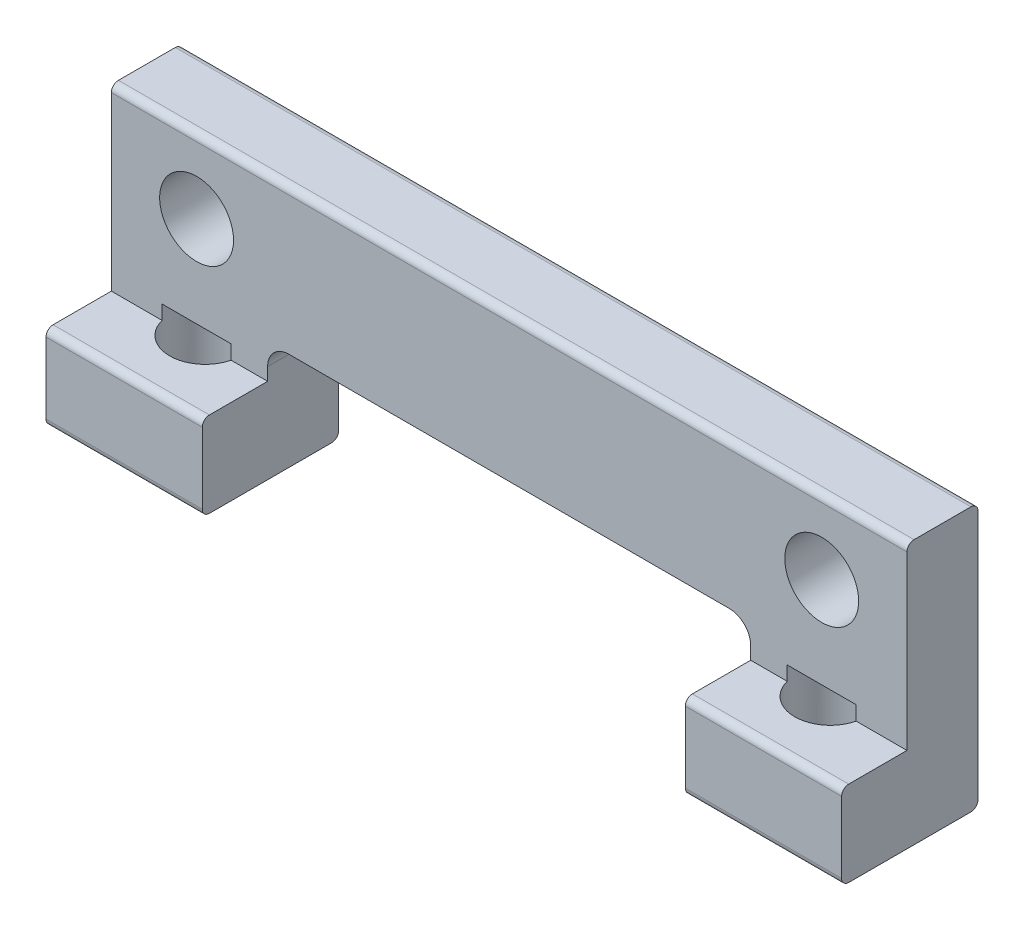
ISO-10303-21;
HEADER;
FILE_DESCRIPTION(('STEP AP214'),'2;1');
FILE_NAME('part.step','',(''),(''),'','','');
FILE_SCHEMA(('AUTOMOTIVE_DESIGN { 1 0 10303 214 1 1 1 1 }'));
ENDSEC;
DATA;
#1=APPLICATION_CONTEXT('core data for automotive mechanical design processes');
#2=APPLICATION_PROTOCOL_DEFINITION('international standard','automotive_design',2000,#1);
#3=PRODUCT_CONTEXT('',#1,'mechanical');
#4=PRODUCT('Part','Part','',(#3));
#5=PRODUCT_RELATED_PRODUCT_CATEGORY('part','',(#4));
#6=PRODUCT_DEFINITION_FORMATION('','',#4);
#7=PRODUCT_DEFINITION_CONTEXT('part definition',#1,'design');
#8=PRODUCT_DEFINITION('design','',#6,#7);
#9=PRODUCT_DEFINITION_SHAPE('','',#8);
#10=(LENGTH_UNIT() NAMED_UNIT(*) SI_UNIT(.MILLI.,.METRE.));
#11=(NAMED_UNIT(*) PLANE_ANGLE_UNIT() SI_UNIT($,.RADIAN.));
#12=(NAMED_UNIT(*) SI_UNIT($,.STERADIAN.) SOLID_ANGLE_UNIT());
#13=UNCERTAINTY_MEASURE_WITH_UNIT(LENGTH_MEASURE(1.E-05),#10,'distance_accuracy_value','');
#14=(GEOMETRIC_REPRESENTATION_CONTEXT(3) GLOBAL_UNCERTAINTY_ASSIGNED_CONTEXT((#13)) GLOBAL_UNIT_ASSIGNED_CONTEXT((#10,
#11,#12)) REPRESENTATION_CONTEXT('',''));
#15=CARTESIAN_POINT('',(0.,0.,0.));
#16=DIRECTION('',(0.,0.,1.));
#17=DIRECTION('',(1.,0.,0.));
#18=AXIS2_PLACEMENT_3D('',#15,#16,#17);
#19=CARTESIAN_POINT('',(0.,0.,4.8));
#20=DIRECTION('',(0.,1.,0.));
#21=DIRECTION('',(0.,0.,1.));
#22=AXIS2_PLACEMENT_3D('',#19,#20,#21);
#23=PLANE('',#22);
#24=CARTESIAN_POINT('',(3.,0.,2.2));
#25=DIRECTION('',(0.,-1.,0.));
#26=DIRECTION('',(0.,0.,-1.));
#27=AXIS2_PLACEMENT_3D('',#24,#25,#26);
#28=CIRCLE('',#27,1.25);
#29=CARTESIAN_POINT('',(3.,0.,0.95));
#30=VERTEX_POINT('',#29);
#31=EDGE_CURVE('E222',#30,#30,#28,.T.);
#32=ORIENTED_EDGE('',*,*,#31,.F.);
#33=EDGE_LOOP('',(#32));
#34=FACE_BOUND('',#33,.T.);
#35=DIRECTION('',(0.,0.,-1.));
#36=VECTOR('',#35,1.);
#37=CARTESIAN_POINT('',(0.,0.,4.8));
#38=LINE('',#37,#36);
#39=CARTESIAN_POINT('',(0.,0.,4.55));
#40=VERTEX_POINT('',#39);
#41=CARTESIAN_POINT('',(0.,0.,0.25));
#42=VERTEX_POINT('',#41);
#43=EDGE_CURVE('E310',#40,#42,#38,.T.);
#44=ORIENTED_EDGE('',*,*,#43,.T.);
#45=DIRECTION('',(1.,0.,0.));
#46=VECTOR('',#45,1.);
#47=CARTESIAN_POINT('',(5.5,0.,0.25));
#48=LINE('',#47,#46);
#49=CARTESIAN_POINT('',(5.5,0.,0.25));
#50=VERTEX_POINT('',#49);
#51=EDGE_CURVE('E11',#42,#50,#48,.T.);
#52=ORIENTED_EDGE('',*,*,#51,.T.);
#53=DIRECTION('',(0.,0.,1.));
#54=VECTOR('',#53,1.);
#55=CARTESIAN_POINT('',(5.5,0.,0.));
#56=LINE('',#55,#54);
#57=CARTESIAN_POINT('',(5.5,0.,4.55));
#58=VERTEX_POINT('',#57);
#59=EDGE_CURVE('E311',#50,#58,#56,.T.);
#60=ORIENTED_EDGE('',*,*,#59,.T.);
#61=DIRECTION('',(1.,0.,0.));
#62=VECTOR('',#61,1.);
#63=CARTESIAN_POINT('',(0.,0.,4.55));
#64=LINE('',#63,#62);
#65=EDGE_CURVE('E42',#58,#40,#64,.F.);
#66=ORIENTED_EDGE('',*,*,#65,.T.);
#67=EDGE_LOOP('',(#44,#52,#60,#66));
#68=FACE_BOUND('',#67,.T.);
#69=ADVANCED_FACE('F34',(#34,#68),#23,.F.);
#70=CARTESIAN_POINT('',(0.,0.,4.8));
#71=DIRECTION('',(0.,0.,-1.));
#72=DIRECTION('',(-1.,0.,0.));
#73=AXIS2_PLACEMENT_3D('',#70,#71,#72);
#74=PLANE('',#73);
#75=DIRECTION('',(0.,1.,0.));
#76=VECTOR('',#75,1.);
#77=CARTESIAN_POINT('',(5.5,0.,4.8));
#78=LINE('',#77,#76);
#79=CARTESIAN_POINT('',(5.5,0.25,4.8));
#80=VERTEX_POINT('',#79);
#81=CARTESIAN_POINT('',(5.5,2.75,4.8));
#82=VERTEX_POINT('',#81);
#83=EDGE_CURVE('E328',#80,#82,#78,.T.);
#84=ORIENTED_EDGE('',*,*,#83,.T.);
#85=DIRECTION('',(1.,0.,0.));
#86=VECTOR('',#85,1.);
#87=CARTESIAN_POINT('',(0.,2.75,4.8));
#88=LINE('',#87,#86);
#89=CARTESIAN_POINT('',(0.,2.75,4.8));
#90=VERTEX_POINT('',#89);
#91=EDGE_CURVE('E300',#82,#90,#88,.F.);
#92=ORIENTED_EDGE('',*,*,#91,.T.);
#93=DIRECTION('',(0.,-1.,0.));
#94=VECTOR('',#93,1.);
#95=CARTESIAN_POINT('',(0.,0.,4.8));
#96=LINE('',#95,#94);
#97=CARTESIAN_POINT('',(0.,0.25,4.8));
#98=VERTEX_POINT('',#97);
#99=EDGE_CURVE('E330',#90,#98,#96,.T.);
#100=ORIENTED_EDGE('',*,*,#99,.T.);
#101=DIRECTION('',(1.,0.,0.));
#102=VECTOR('',#101,1.);
#103=CARTESIAN_POINT('',(0.,0.25,4.8));
#104=LINE('',#103,#102);
#105=EDGE_CURVE('E297',#98,#80,#104,.T.);
#106=ORIENTED_EDGE('',*,*,#105,.T.);
#107=EDGE_LOOP('',(#84,#92,#100,#106));
#108=FACE_BOUND('',#107,.T.);
#109=ADVANCED_FACE('F327',(#108),#74,.F.);
#110=CARTESIAN_POINT('',(0.,3.,2.5));
#111=DIRECTION('',(0.,-1.,0.));
#112=DIRECTION('',(0.,0.,-1.));
#113=AXIS2_PLACEMENT_3D('',#110,#111,#112);
#114=PLANE('',#113);
#115=DIRECTION('',(0.,0.,1.));
#116=VECTOR('',#115,1.);
#117=CARTESIAN_POINT('',(0.,3.,2.5));
#118=LINE('',#117,#116);
#119=CARTESIAN_POINT('',(0.,3.,2.5));
#120=VERTEX_POINT('',#119);
#121=CARTESIAN_POINT('',(0.,3.,4.55));
#122=VERTEX_POINT('',#121);
#123=EDGE_CURVE('E348',#120,#122,#118,.T.);
#124=ORIENTED_EDGE('',*,*,#123,.T.);
#125=DIRECTION('',(1.,0.,0.));
#126=VECTOR('',#125,1.);
#127=CARTESIAN_POINT('',(0.,3.,4.55));
#128=LINE('',#127,#126);
#129=CARTESIAN_POINT('',(5.5,3.,4.55));
#130=VERTEX_POINT('',#129);
#131=EDGE_CURVE('E290',#122,#130,#128,.T.);
#132=ORIENTED_EDGE('',*,*,#131,.T.);
#133=DIRECTION('',(0.,0.,-1.));
#134=VECTOR('',#133,1.);
#135=CARTESIAN_POINT('',(5.5,3.,2.5));
#136=LINE('',#135,#134);
#137=CARTESIAN_POINT('',(5.5,3.,2.5));
#138=VERTEX_POINT('',#137);
#139=EDGE_CURVE('E334',#130,#138,#136,.T.);
#140=ORIENTED_EDGE('',*,*,#139,.T.);
#141=DIRECTION('',(1.,0.,0.));
#142=VECTOR('',#141,1.);
#143=CARTESIAN_POINT('',(0.,3.,2.5));
#144=LINE('',#143,#142);
#145=CARTESIAN_POINT('',(4.21346610995116,3.,2.5));
#146=VERTEX_POINT('',#145);
#147=EDGE_CURVE('E346',#146,#138,#144,.T.);
#148=ORIENTED_EDGE('',*,*,#147,.F.);
#149=CARTESIAN_POINT('',(3.,3.,2.2));
#150=DIRECTION('',(0.,-1.,0.));
#151=DIRECTION('',(0.,0.,-1.));
#152=AXIS2_PLACEMENT_3D('',#149,#150,#151);
#153=CIRCLE('',#152,1.25);
#154=CARTESIAN_POINT('',(1.78653389004884,3.,2.5));
#155=VERTEX_POINT('',#154);
#156=EDGE_CURVE('E750',#146,#155,#153,.T.);
#157=ORIENTED_EDGE('',*,*,#156,.T.);
#158=EDGE_CURVE('E342',#120,#155,#144,.T.);
#159=ORIENTED_EDGE('',*,*,#158,.F.);
#160=EDGE_LOOP('',(#124,#132,#140,#148,#157,#159));
#161=FACE_BOUND('',#160,.T.);
#162=ADVANCED_FACE('F453',(#161),#114,.F.);
#163=CARTESIAN_POINT('',(0.,0.,4.8));
#164=DIRECTION('',(1.,0.,0.));
#165=DIRECTION('',(0.,0.,-1.));
#166=AXIS2_PLACEMENT_3D('',#163,#164,#165);
#167=PLANE('',#166);
#168=DIRECTION('',(0.,0.,-1.));
#169=VECTOR('',#168,1.);
#170=CARTESIAN_POINT('',(0.,9.3,4.8));
#171=LINE('',#170,#169);
#172=CARTESIAN_POINT('',(0.,9.3,2.25));
#173=VERTEX_POINT('',#172);
#174=CARTESIAN_POINT('',(0.,9.3,0.25));
#175=VERTEX_POINT('',#174);
#176=EDGE_CURVE('E360',#173,#175,#171,.T.);
#177=ORIENTED_EDGE('',*,*,#176,.T.);
#178=CARTESIAN_POINT('',(0.,9.05,0.25));
#179=DIRECTION('',(1.,0.,0.));
#180=DIRECTION('',(0.,0.,-1.));
#181=AXIS2_PLACEMENT_3D('',#178,#179,#180);
#182=CIRCLE('',#181,0.25);
#183=CARTESIAN_POINT('',(0.,9.05,0.));
#184=VERTEX_POINT('',#183);
#185=EDGE_CURVE('E255',#175,#184,#182,.F.);
#186=ORIENTED_EDGE('',*,*,#185,.T.);
#187=DIRECTION('',(0.,-1.,0.));
#188=VECTOR('',#187,1.);
#189=CARTESIAN_POINT('',(0.,0.,0.));
#190=LINE('',#189,#188);
#191=CARTESIAN_POINT('',(0.,0.25,0.));
#192=VERTEX_POINT('',#191);
#193=EDGE_CURVE('E352',#184,#192,#190,.T.);
#194=ORIENTED_EDGE('',*,*,#193,.T.);
#195=CARTESIAN_POINT('',(0.,0.25,0.25));
#196=DIRECTION('',(1.,0.,0.));
#197=DIRECTION('',(0.,0.,-1.));
#198=AXIS2_PLACEMENT_3D('',#195,#196,#197);
#199=CIRCLE('',#198,0.25);
#200=EDGE_CURVE('E249',#192,#42,#199,.F.);
#201=ORIENTED_EDGE('',*,*,#200,.T.);
#202=ORIENTED_EDGE('',*,*,#43,.F.);
#203=CARTESIAN_POINT('',(0.,0.25,4.55));
#204=DIRECTION('',(1.,0.,0.));
#205=DIRECTION('',(0.,0.,-1.));
#206=AXIS2_PLACEMENT_3D('',#203,#204,#205);
#207=CIRCLE('',#206,0.25);
#208=EDGE_CURVE('E247',#40,#98,#207,.F.);
#209=ORIENTED_EDGE('',*,*,#208,.T.);
#210=ORIENTED_EDGE('',*,*,#99,.F.);
#211=CARTESIAN_POINT('',(0.,2.75,4.55));
#212=DIRECTION('',(1.,0.,0.));
#213=DIRECTION('',(0.,0.,-1.));
#214=AXIS2_PLACEMENT_3D('',#211,#212,#213);
#215=CIRCLE('',#214,0.25);
#216=EDGE_CURVE('E251',#90,#122,#215,.F.);
#217=ORIENTED_EDGE('',*,*,#216,.T.);
#218=ORIENTED_EDGE('',*,*,#123,.F.);
#219=DIRECTION('',(0.,-1.,0.));
#220=VECTOR('',#219,1.);
#221=CARTESIAN_POINT('',(0.,3.,2.5));
#222=LINE('',#221,#220);
#223=CARTESIAN_POINT('',(0.,9.05,2.5));
#224=VERTEX_POINT('',#223);
#225=EDGE_CURVE('E333',#224,#120,#222,.T.);
#226=ORIENTED_EDGE('',*,*,#225,.F.);
#227=CARTESIAN_POINT('',(0.,9.05,2.25));
#228=DIRECTION('',(1.,0.,0.));
#229=DIRECTION('',(0.,0.,-1.));
#230=AXIS2_PLACEMENT_3D('',#227,#228,#229);
#231=CIRCLE('',#230,0.25);
#232=EDGE_CURVE('E253',#224,#173,#231,.F.);
#233=ORIENTED_EDGE('',*,*,#232,.T.);
#234=EDGE_LOOP('',(#177,#186,#194,#201,#202,#209,#210,#217,#218,#226,#233));
#235=FACE_BOUND('',#234,.T.);
#236=ADVANCED_FACE('F316',(#235),#167,.F.);
#237=CARTESIAN_POINT('',(25.,0.,2.2));
#238=DIRECTION('',(0.,-1.,0.));
#239=DIRECTION('',(0.,0.,1.));
#240=AXIS2_PLACEMENT_3D('',#237,#238,#239);
#241=CIRCLE('',#240,1.25);
#242=CARTESIAN_POINT('',(25.,0.,3.45));
#243=VERTEX_POINT('',#242);
#244=EDGE_CURVE('E223',#243,#243,#241,.T.);
#245=ORIENTED_EDGE('',*,*,#244,.F.);
#246=EDGE_LOOP('',(#245));
#247=FACE_BOUND('',#246,.T.);
#248=DIRECTION('',(0.,0.,1.));
#249=VECTOR('',#248,1.);
#250=CARTESIAN_POINT('',(22.5,0.,0.));
#251=LINE('',#250,#249);
#252=CARTESIAN_POINT('',(22.5,0.,0.25));
#253=VERTEX_POINT('',#252);
#254=CARTESIAN_POINT('',(22.5,0.,4.55));
#255=VERTEX_POINT('',#254);
#256=EDGE_CURVE('E431',#253,#255,#251,.T.);
#257=ORIENTED_EDGE('',*,*,#256,.F.);
#258=DIRECTION('',(1.,0.,0.));
#259=VECTOR('',#258,1.);
#260=CARTESIAN_POINT('',(28.,0.,0.25));
#261=LINE('',#260,#259);
#262=CARTESIAN_POINT('',(28.,0.,0.25));
#263=VERTEX_POINT('',#262);
#264=EDGE_CURVE('E304',#253,#263,#261,.T.);
#265=ORIENTED_EDGE('',*,*,#264,.T.);
#266=DIRECTION('',(0.,0.,-1.));
#267=VECTOR('',#266,1.);
#268=CARTESIAN_POINT('',(28.,0.,4.8));
#269=LINE('',#268,#267);
#270=CARTESIAN_POINT('',(28.,0.,4.55));
#271=VERTEX_POINT('',#270);
#272=EDGE_CURVE('E322',#271,#263,#269,.T.);
#273=ORIENTED_EDGE('',*,*,#272,.F.);
#274=DIRECTION('',(1.,0.,0.));
#275=VECTOR('',#274,1.);
#276=CARTESIAN_POINT('',(0.,0.,4.55));
#277=LINE('',#276,#275);
#278=EDGE_CURVE('E302',#271,#255,#277,.F.);
#279=ORIENTED_EDGE('',*,*,#278,.T.);
#280=EDGE_LOOP('',(#257,#265,#273,#279));
#281=FACE_BOUND('',#280,.T.);
#282=ADVANCED_FACE('F473',(#247,#281),#23,.F.);
#283=CARTESIAN_POINT('',(28.,0.,4.8));
#284=DIRECTION('',(-1.,0.,0.));
#285=DIRECTION('',(0.,0.,1.));
#286=AXIS2_PLACEMENT_3D('',#283,#284,#285);
#287=PLANE('',#286);
#288=DIRECTION('',(0.,1.,0.));
#289=VECTOR('',#288,1.);
#290=CARTESIAN_POINT('',(28.,0.,0.));
#291=LINE('',#290,#289);
#292=CARTESIAN_POINT('',(28.,0.25,0.));
#293=VERTEX_POINT('',#292);
#294=CARTESIAN_POINT('',(28.,9.05,0.));
#295=VERTEX_POINT('',#294);
#296=EDGE_CURVE('E357',#293,#295,#291,.T.);
#297=ORIENTED_EDGE('',*,*,#296,.T.);
#298=CARTESIAN_POINT('',(28.,9.05,0.25));
#299=DIRECTION('',(-1.,0.,0.));
#300=DIRECTION('',(0.,0.,1.));
#301=AXIS2_PLACEMENT_3D('',#298,#299,#300);
#302=CIRCLE('',#301,0.25);
#303=CARTESIAN_POINT('',(28.,9.3,0.25));
#304=VERTEX_POINT('',#303);
#305=EDGE_CURVE('E271',#295,#304,#302,.F.);
#306=ORIENTED_EDGE('',*,*,#305,.T.);
#307=DIRECTION('',(0.,0.,-1.));
#308=VECTOR('',#307,1.);
#309=CARTESIAN_POINT('',(28.,9.3,4.8));
#310=LINE('',#309,#308);
#311=CARTESIAN_POINT('',(28.,9.3,2.25));
#312=VERTEX_POINT('',#311);
#313=EDGE_CURVE('E365',#312,#304,#310,.T.);
#314=ORIENTED_EDGE('',*,*,#313,.F.);
#315=CARTESIAN_POINT('',(28.,9.05,2.25));
#316=DIRECTION('',(-1.,0.,0.));
#317=DIRECTION('',(0.,0.,1.));
#318=AXIS2_PLACEMENT_3D('',#315,#316,#317);
#319=CIRCLE('',#318,0.25);
#320=CARTESIAN_POINT('',(28.,9.05,2.5));
#321=VERTEX_POINT('',#320);
#322=EDGE_CURVE('E269',#312,#321,#319,.F.);
#323=ORIENTED_EDGE('',*,*,#322,.T.);
#324=DIRECTION('',(0.,1.,0.));
#325=VECTOR('',#324,1.);
#326=CARTESIAN_POINT('',(28.,3.,2.5));
#327=LINE('',#326,#325);
#328=CARTESIAN_POINT('',(28.,3.,2.5));
#329=VERTEX_POINT('',#328);
#330=EDGE_CURVE('E345',#329,#321,#327,.T.);
#331=ORIENTED_EDGE('',*,*,#330,.F.);
#332=DIRECTION('',(0.,0.,1.));
#333=VECTOR('',#332,1.);
#334=CARTESIAN_POINT('',(28.,3.,2.5));
#335=LINE('',#334,#333);
#336=CARTESIAN_POINT('',(28.,3.,4.55));
#337=VERTEX_POINT('',#336);
#338=EDGE_CURVE('E349',#329,#337,#335,.T.);
#339=ORIENTED_EDGE('',*,*,#338,.T.);
#340=CARTESIAN_POINT('',(28.,2.75,4.55));
#341=DIRECTION('',(-1.,0.,0.));
#342=DIRECTION('',(0.,0.,1.));
#343=AXIS2_PLACEMENT_3D('',#340,#341,#342);
#344=CIRCLE('',#343,0.25);
#345=CARTESIAN_POINT('',(28.,2.75,4.8));
#346=VERTEX_POINT('',#345);
#347=EDGE_CURVE('E267',#337,#346,#344,.F.);
#348=ORIENTED_EDGE('',*,*,#347,.T.);
#349=DIRECTION('',(0.,1.,0.));
#350=VECTOR('',#349,1.);
#351=CARTESIAN_POINT('',(28.,0.,4.8));
#352=LINE('',#351,#350);
#353=CARTESIAN_POINT('',(28.,0.25,4.8));
#354=VERTEX_POINT('',#353);
#355=EDGE_CURVE('E356',#354,#346,#352,.T.);
#356=ORIENTED_EDGE('',*,*,#355,.F.);
#357=CARTESIAN_POINT('',(28.,0.25,4.55));
#358=DIRECTION('',(-1.,0.,0.));
#359=DIRECTION('',(0.,0.,1.));
#360=AXIS2_PLACEMENT_3D('',#357,#358,#359);
#361=CIRCLE('',#360,0.25);
#362=EDGE_CURVE('E263',#354,#271,#361,.F.);
#363=ORIENTED_EDGE('',*,*,#362,.T.);
#364=ORIENTED_EDGE('',*,*,#272,.T.);
#365=CARTESIAN_POINT('',(28.,0.25,0.25));
#366=DIRECTION('',(-1.,0.,0.));
#367=DIRECTION('',(0.,0.,1.));
#368=AXIS2_PLACEMENT_3D('',#365,#366,#367);
#369=CIRCLE('',#368,0.25);
#370=EDGE_CURVE('E265',#263,#293,#369,.F.);
#371=ORIENTED_EDGE('',*,*,#370,.T.);
#372=EDGE_LOOP('',(#297,#306,#314,#323,#331,#339,#348,#356,#363,#364,#371));
#373=FACE_BOUND('',#372,.T.);
#374=ADVANCED_FACE('F440',(#373),#287,.F.);
#375=CARTESIAN_POINT('',(0.,9.3,4.8));
#376=DIRECTION('',(0.,-1.,0.));
#377=DIRECTION('',(0.,0.,-1.));
#378=AXIS2_PLACEMENT_3D('',#375,#376,#377);
#379=PLANE('',#378);
#380=ORIENTED_EDGE('',*,*,#313,.T.);
#381=DIRECTION('',(-1.,0.,0.));
#382=VECTOR('',#381,1.);
#383=CARTESIAN_POINT('',(0.,9.3,0.25));
#384=LINE('',#383,#382);
#385=EDGE_CURVE('E244',#304,#175,#384,.T.);
#386=ORIENTED_EDGE('',*,*,#385,.T.);
#387=ORIENTED_EDGE('',*,*,#176,.F.);
#388=DIRECTION('',(-1.,0.,0.));
#389=VECTOR('',#388,1.);
#390=CARTESIAN_POINT('',(0.,9.3,2.25));
#391=LINE('',#390,#389);
#392=EDGE_CURVE('E242',#173,#312,#391,.F.);
#393=ORIENTED_EDGE('',*,*,#392,.T.);
#394=EDGE_LOOP('',(#380,#386,#387,#393));
#395=FACE_BOUND('',#394,.T.);
#396=ADVANCED_FACE('F488',(#395),#379,.F.);
#397=ORIENTED_EDGE('',*,*,#355,.T.);
#398=DIRECTION('',(1.,0.,0.));
#399=VECTOR('',#398,1.);
#400=CARTESIAN_POINT('',(0.,2.75,4.8));
#401=LINE('',#400,#399);
#402=CARTESIAN_POINT('',(22.5,2.75,4.8));
#403=VERTEX_POINT('',#402);
#404=EDGE_CURVE('E282',#346,#403,#401,.F.);
#405=ORIENTED_EDGE('',*,*,#404,.T.);
#406=DIRECTION('',(0.,-1.,0.));
#407=VECTOR('',#406,1.);
#408=CARTESIAN_POINT('',(22.5,0.,4.8));
#409=LINE('',#408,#407);
#410=CARTESIAN_POINT('',(22.5,0.25,4.8));
#411=VERTEX_POINT('',#410);
#412=EDGE_CURVE('E338',#403,#411,#409,.T.);
#413=ORIENTED_EDGE('',*,*,#412,.T.);
#414=DIRECTION('',(1.,0.,0.));
#415=VECTOR('',#414,1.);
#416=CARTESIAN_POINT('',(0.,0.25,4.8));
#417=LINE('',#416,#415);
#418=EDGE_CURVE('E279',#411,#354,#417,.T.);
#419=ORIENTED_EDGE('',*,*,#418,.T.);
#420=EDGE_LOOP('',(#397,#405,#413,#419));
#421=FACE_BOUND('',#420,.T.);
#422=ADVANCED_FACE('F478',(#421),#74,.F.);
#423=CARTESIAN_POINT('',(0.,0.,0.));
#424=DIRECTION('',(0.,0.,-1.));
#425=DIRECTION('',(-1.,0.,0.));
#426=AXIS2_PLACEMENT_3D('',#423,#424,#425);
#427=PLANE('',#426);
#428=CARTESIAN_POINT('',(3.,6.7,0.));
#429=DIRECTION('',(0.,0.,1.));
#430=DIRECTION('',(1.,0.,0.));
#431=AXIS2_PLACEMENT_3D('',#428,#429,#430);
#432=CIRCLE('',#431,1.3);
#433=CARTESIAN_POINT('',(4.3,6.7,0.));
#434=VERTEX_POINT('',#433);
#435=EDGE_CURVE('E408',#434,#434,#432,.T.);
#436=ORIENTED_EDGE('',*,*,#435,.T.);
#437=EDGE_LOOP('',(#436));
#438=FACE_BOUND('',#437,.T.);
#439=CARTESIAN_POINT('',(25.,6.7,0.));
#440=DIRECTION('',(0.,0.,1.));
#441=DIRECTION('',(-1.,0.,0.));
#442=AXIS2_PLACEMENT_3D('',#439,#440,#441);
#443=CIRCLE('',#442,1.3);
#444=CARTESIAN_POINT('',(23.7,6.7,0.));
#445=VERTEX_POINT('',#444);
#446=EDGE_CURVE('E745',#445,#445,#443,.T.);
#447=ORIENTED_EDGE('',*,*,#446,.T.);
#448=EDGE_LOOP('',(#447));
#449=FACE_BOUND('',#448,.T.);
#450=ORIENTED_EDGE('',*,*,#193,.F.);
#451=DIRECTION('',(-1.,0.,0.));
#452=VECTOR('',#451,1.);
#453=CARTESIAN_POINT('',(28.,9.05,0.));
#454=LINE('',#453,#452);
#455=EDGE_CURVE('E261',#184,#295,#454,.F.);
#456=ORIENTED_EDGE('',*,*,#455,.T.);
#457=ORIENTED_EDGE('',*,*,#296,.F.);
#458=DIRECTION('',(1.,0.,0.));
#459=VECTOR('',#458,1.);
#460=CARTESIAN_POINT('',(22.5,0.25,0.));
#461=LINE('',#460,#459);
#462=CARTESIAN_POINT('',(22.5,0.25,0.));
#463=VERTEX_POINT('',#462);
#464=EDGE_CURVE('E259',#293,#463,#461,.F.);
#465=ORIENTED_EDGE('',*,*,#464,.T.);
#466=DIRECTION('',(0.,1.,0.));
#467=VECTOR('',#466,1.);
#468=CARTESIAN_POINT('',(22.5,0.,0.));
#469=LINE('',#468,#467);
#470=CARTESIAN_POINT('',(22.5,3.45,0.));
#471=VERTEX_POINT('',#470);
#472=EDGE_CURVE('E407',#463,#471,#469,.T.);
#473=ORIENTED_EDGE('',*,*,#472,.T.);
#474=CARTESIAN_POINT('',(21.75,3.45,0.));
#475=DIRECTION('',(0.,0.,-1.));
#476=DIRECTION('',(-1.,0.,0.));
#477=AXIS2_PLACEMENT_3D('',#474,#475,#476);
#478=CIRCLE('',#477,0.75);
#479=CARTESIAN_POINT('',(21.75,4.2,0.));
#480=VERTEX_POINT('',#479);
#481=EDGE_CURVE('E390',#471,#480,#478,.F.);
#482=ORIENTED_EDGE('',*,*,#481,.T.);
#483=DIRECTION('',(-1.,0.,0.));
#484=VECTOR('',#483,1.);
#485=CARTESIAN_POINT('',(5.5,4.2,0.));
#486=LINE('',#485,#484);
#487=CARTESIAN_POINT('',(6.25,4.2,0.));
#488=VERTEX_POINT('',#487);
#489=EDGE_CURVE('E402',#480,#488,#486,.T.);
#490=ORIENTED_EDGE('',*,*,#489,.T.);
#491=CARTESIAN_POINT('',(6.25,3.45,0.));
#492=DIRECTION('',(0.,0.,-1.));
#493=DIRECTION('',(-1.,0.,0.));
#494=AXIS2_PLACEMENT_3D('',#491,#492,#493);
#495=CIRCLE('',#494,0.75);
#496=CARTESIAN_POINT('',(5.5,3.45,0.));
#497=VERTEX_POINT('',#496);
#498=EDGE_CURVE('E216',#488,#497,#495,.F.);
#499=ORIENTED_EDGE('',*,*,#498,.T.);
#500=DIRECTION('',(0.,-1.,0.));
#501=VECTOR('',#500,1.);
#502=CARTESIAN_POINT('',(5.5,0.,0.));
#503=LINE('',#502,#501);
#504=CARTESIAN_POINT('',(5.5,0.25,0.));
#505=VERTEX_POINT('',#504);
#506=EDGE_CURVE('E400',#497,#505,#503,.T.);
#507=ORIENTED_EDGE('',*,*,#506,.T.);
#508=DIRECTION('',(1.,0.,0.));
#509=VECTOR('',#508,1.);
#510=CARTESIAN_POINT('',(0.,0.25,0.));
#511=LINE('',#510,#509);
#512=EDGE_CURVE('E257',#505,#192,#511,.F.);
#513=ORIENTED_EDGE('',*,*,#512,.T.);
#514=EDGE_LOOP('',(#450,#456,#457,#465,#473,#482,#490,#499,#507,#513));
#515=FACE_BOUND('',#514,.T.);
#516=ADVANCED_FACE('F399',(#438,#449,#515),#427,.T.);
#517=DIRECTION('',(0.,0.,1.));
#518=VECTOR('',#517,1.);
#519=CARTESIAN_POINT('',(22.5,3.,2.5));
#520=LINE('',#519,#518);
#521=CARTESIAN_POINT('',(22.5,3.,2.5));
#522=VERTEX_POINT('',#521);
#523=CARTESIAN_POINT('',(22.5,3.,4.55));
#524=VERTEX_POINT('',#523);
#525=EDGE_CURVE('E427',#522,#524,#520,.T.);
#526=ORIENTED_EDGE('',*,*,#525,.T.);
#527=DIRECTION('',(1.,0.,0.));
#528=VECTOR('',#527,1.);
#529=CARTESIAN_POINT('',(0.,3.,4.55));
#530=LINE('',#529,#528);
#531=EDGE_CURVE('E276',#524,#337,#530,.T.);
#532=ORIENTED_EDGE('',*,*,#531,.T.);
#533=ORIENTED_EDGE('',*,*,#338,.F.);
#534=CARTESIAN_POINT('',(26.2134661099512,3.,2.5));
#535=VERTEX_POINT('',#534);
#536=EDGE_CURVE('E336',#535,#329,#144,.T.);
#537=ORIENTED_EDGE('',*,*,#536,.F.);
#538=CARTESIAN_POINT('',(25.,3.,2.2));
#539=DIRECTION('',(0.,-1.,0.));
#540=DIRECTION('',(0.,0.,-1.));
#541=AXIS2_PLACEMENT_3D('',#538,#539,#540);
#542=CIRCLE('',#541,1.25);
#543=CARTESIAN_POINT('',(23.7865338900488,3.,2.5));
#544=VERTEX_POINT('',#543);
#545=EDGE_CURVE('E435',#535,#544,#542,.T.);
#546=ORIENTED_EDGE('',*,*,#545,.T.);
#547=EDGE_CURVE('E229',#522,#544,#144,.T.);
#548=ORIENTED_EDGE('',*,*,#547,.F.);
#549=EDGE_LOOP('',(#526,#532,#533,#537,#546,#548));
#550=FACE_BOUND('',#549,.T.);
#551=ADVANCED_FACE('F433',(#550),#114,.F.);
#552=CARTESIAN_POINT('',(0.,0.,2.5));
#553=DIRECTION('',(0.,0.,-1.));
#554=DIRECTION('',(-1.,0.,0.));
#555=AXIS2_PLACEMENT_3D('',#552,#553,#554);
#556=PLANE('',#555);
#557=CARTESIAN_POINT('',(3.,6.7,2.5));
#558=DIRECTION('',(0.,0.,1.));
#559=DIRECTION('',(1.,0.,0.));
#560=AXIS2_PLACEMENT_3D('',#557,#558,#559);
#561=CIRCLE('',#560,1.3);
#562=CARTESIAN_POINT('',(4.3,6.7,2.5));
#563=VERTEX_POINT('',#562);
#564=EDGE_CURVE('E752',#563,#563,#561,.T.);
#565=ORIENTED_EDGE('',*,*,#564,.F.);
#566=EDGE_LOOP('',(#565));
#567=FACE_BOUND('',#566,.T.);
#568=CARTESIAN_POINT('',(25.,6.7,2.5));
#569=DIRECTION('',(0.,0.,1.));
#570=DIRECTION('',(-1.,0.,0.));
#571=AXIS2_PLACEMENT_3D('',#568,#569,#570);
#572=CIRCLE('',#571,1.3);
#573=CARTESIAN_POINT('',(23.7,6.7,2.5));
#574=VERTEX_POINT('',#573);
#575=EDGE_CURVE('E748',#574,#574,#572,.T.);
#576=ORIENTED_EDGE('',*,*,#575,.F.);
#577=EDGE_LOOP('',(#576));
#578=FACE_BOUND('',#577,.T.);
#579=ORIENTED_EDGE('',*,*,#330,.T.);
#580=DIRECTION('',(-1.,0.,0.));
#581=VECTOR('',#580,1.);
#582=CARTESIAN_POINT('',(0.,9.05,2.5));
#583=LINE('',#582,#581);
#584=EDGE_CURVE('E273',#321,#224,#583,.T.);
#585=ORIENTED_EDGE('',*,*,#584,.T.);
#586=ORIENTED_EDGE('',*,*,#225,.T.);
#587=ORIENTED_EDGE('',*,*,#158,.T.);
#588=DIRECTION('',(0.,-1.,0.));
#589=VECTOR('',#588,1.);
#590=CARTESIAN_POINT('',(1.78653389004884,3.5,2.5));
#591=LINE('',#590,#589);
#592=CARTESIAN_POINT('',(1.78653389004884,3.5,2.5));
#593=VERTEX_POINT('',#592);
#594=EDGE_CURVE('E236',#155,#593,#591,.F.);
#595=ORIENTED_EDGE('',*,*,#594,.T.);
#596=DIRECTION('',(-1.,0.,0.));
#597=VECTOR('',#596,1.);
#598=CARTESIAN_POINT('',(0.,3.5,2.5));
#599=LINE('',#598,#597);
#600=CARTESIAN_POINT('',(4.21346610995116,3.5,2.5));
#601=VERTEX_POINT('',#600);
#602=EDGE_CURVE('E231',#601,#593,#599,.T.);
#603=ORIENTED_EDGE('',*,*,#602,.F.);
#604=DIRECTION('',(0.,-1.,0.));
#605=VECTOR('',#604,1.);
#606=CARTESIAN_POINT('',(4.21346610995116,3.5,2.5));
#607=LINE('',#606,#605);
#608=EDGE_CURVE('E239',#601,#146,#607,.T.);
#609=ORIENTED_EDGE('',*,*,#608,.T.);
#610=ORIENTED_EDGE('',*,*,#147,.T.);
#611=DIRECTION('',(0.,1.,0.));
#612=VECTOR('',#611,1.);
#613=CARTESIAN_POINT('',(5.5,0.,2.5));
#614=LINE('',#613,#612);
#615=CARTESIAN_POINT('',(5.5,3.45,2.5));
#616=VERTEX_POINT('',#615);
#617=EDGE_CURVE('E374',#138,#616,#614,.T.);
#618=ORIENTED_EDGE('',*,*,#617,.T.);
#619=CARTESIAN_POINT('',(6.25,3.45,2.5));
#620=DIRECTION('',(0.,0.,-1.));
#621=DIRECTION('',(-1.,0.,0.));
#622=AXIS2_PLACEMENT_3D('',#619,#620,#621);
#623=CIRCLE('',#622,0.75);
#624=CARTESIAN_POINT('',(6.25,4.2,2.5));
#625=VERTEX_POINT('',#624);
#626=EDGE_CURVE('E392',#616,#625,#623,.T.);
#627=ORIENTED_EDGE('',*,*,#626,.T.);
#628=DIRECTION('',(1.,0.,0.));
#629=VECTOR('',#628,1.);
#630=CARTESIAN_POINT('',(0.,4.2,2.5));
#631=LINE('',#630,#629);
#632=CARTESIAN_POINT('',(21.75,4.2,2.5));
#633=VERTEX_POINT('',#632);
#634=EDGE_CURVE('E371',#625,#633,#631,.T.);
#635=ORIENTED_EDGE('',*,*,#634,.T.);
#636=CARTESIAN_POINT('',(21.75,3.45,2.5));
#637=DIRECTION('',(0.,0.,-1.));
#638=DIRECTION('',(-1.,0.,0.));
#639=AXIS2_PLACEMENT_3D('',#636,#637,#638);
#640=CIRCLE('',#639,0.75);
#641=CARTESIAN_POINT('',(22.5,3.45,2.5));
#642=VERTEX_POINT('',#641);
#643=EDGE_CURVE('E388',#633,#642,#640,.T.);
#644=ORIENTED_EDGE('',*,*,#643,.T.);
#645=DIRECTION('',(0.,-1.,0.));
#646=VECTOR('',#645,1.);
#647=CARTESIAN_POINT('',(22.5,0.,2.5));
#648=LINE('',#647,#646);
#649=EDGE_CURVE('E321',#642,#522,#648,.T.);
#650=ORIENTED_EDGE('',*,*,#649,.T.);
#651=ORIENTED_EDGE('',*,*,#547,.T.);
#652=DIRECTION('',(0.,-1.,0.));
#653=VECTOR('',#652,1.);
#654=CARTESIAN_POINT('',(23.7865338900488,3.5,2.5));
#655=LINE('',#654,#653);
#656=CARTESIAN_POINT('',(23.7865338900488,3.5,2.5));
#657=VERTEX_POINT('',#656);
#658=EDGE_CURVE('E215',#544,#657,#655,.F.);
#659=ORIENTED_EDGE('',*,*,#658,.T.);
#660=DIRECTION('',(1.,0.,0.));
#661=VECTOR('',#660,1.);
#662=CARTESIAN_POINT('',(0.,3.5,2.5));
#663=LINE('',#662,#661);
#664=CARTESIAN_POINT('',(26.2134661099512,3.5,2.5));
#665=VERTEX_POINT('',#664);
#666=EDGE_CURVE('E207',#657,#665,#663,.T.);
#667=ORIENTED_EDGE('',*,*,#666,.T.);
#668=DIRECTION('',(0.,-1.,0.));
#669=VECTOR('',#668,1.);
#670=CARTESIAN_POINT('',(26.2134661099512,3.5,2.5));
#671=LINE('',#670,#669);
#672=EDGE_CURVE('E221',#665,#535,#671,.T.);
#673=ORIENTED_EDGE('',*,*,#672,.T.);
#674=ORIENTED_EDGE('',*,*,#536,.T.);
#675=EDGE_LOOP('',(#579,#585,#586,#587,#595,#603,#609,#610,#618,#627,#635,#644,#650,#651,#659,
#667,#673,#674));
#676=FACE_BOUND('',#675,.T.);
#677=ADVANCED_FACE('F227',(#567,#578,#676),#556,.F.);
#678=CARTESIAN_POINT('',(5.5,0.,0.));
#679=DIRECTION('',(-1.,0.,0.));
#680=DIRECTION('',(0.,0.,1.));
#681=AXIS2_PLACEMENT_3D('',#678,#679,#680);
#682=PLANE('',#681);
#683=ORIENTED_EDGE('',*,*,#139,.F.);
#684=CARTESIAN_POINT('',(5.5,2.75,4.55));
#685=DIRECTION('',(-1.,0.,0.));
#686=DIRECTION('',(0.,0.,1.));
#687=AXIS2_PLACEMENT_3D('',#684,#685,#686);
#688=CIRCLE('',#687,0.25);
#689=EDGE_CURVE('E295',#130,#82,#688,.F.);
#690=ORIENTED_EDGE('',*,*,#689,.T.);
#691=ORIENTED_EDGE('',*,*,#83,.F.);
#692=CARTESIAN_POINT('',(5.5,0.25,4.55));
#693=DIRECTION('',(-1.,0.,0.));
#694=DIRECTION('',(0.,0.,1.));
#695=AXIS2_PLACEMENT_3D('',#692,#693,#694);
#696=CIRCLE('',#695,0.25);
#697=EDGE_CURVE('E49',#80,#58,#696,.F.);
#698=ORIENTED_EDGE('',*,*,#697,.T.);
#699=ORIENTED_EDGE('',*,*,#59,.F.);
#700=CARTESIAN_POINT('',(5.5,0.25,0.25));
#701=DIRECTION('',(-1.,0.,0.));
#702=DIRECTION('',(0.,0.,1.));
#703=AXIS2_PLACEMENT_3D('',#700,#701,#702);
#704=CIRCLE('',#703,0.25);
#705=EDGE_CURVE('E57',#50,#505,#704,.F.);
#706=ORIENTED_EDGE('',*,*,#705,.T.);
#707=ORIENTED_EDGE('',*,*,#506,.F.);
#708=DIRECTION('',(0.,0.,1.));
#709=VECTOR('',#708,1.);
#710=CARTESIAN_POINT('',(5.5,3.45,2.5));
#711=LINE('',#710,#709);
#712=EDGE_CURVE('E385',#497,#616,#711,.T.);
#713=ORIENTED_EDGE('',*,*,#712,.T.);
#714=ORIENTED_EDGE('',*,*,#617,.F.);
#715=EDGE_LOOP('',(#683,#690,#691,#698,#699,#706,#707,#713,#714));
#716=FACE_BOUND('',#715,.T.);
#717=ADVANCED_FACE('F332',(#716),#682,.F.);
#718=CARTESIAN_POINT('',(5.5,4.2,0.));
#719=DIRECTION('',(0.,1.,0.));
#720=DIRECTION('',(0.,0.,1.));
#721=AXIS2_PLACEMENT_3D('',#718,#719,#720);
#722=PLANE('',#721);
#723=ORIENTED_EDGE('',*,*,#489,.F.);
#724=DIRECTION('',(0.,0.,1.));
#725=VECTOR('',#724,1.);
#726=CARTESIAN_POINT('',(21.75,4.2,2.5));
#727=LINE('',#726,#725);
#728=EDGE_CURVE('E379',#480,#633,#727,.T.);
#729=ORIENTED_EDGE('',*,*,#728,.T.);
#730=ORIENTED_EDGE('',*,*,#634,.F.);
#731=DIRECTION('',(0.,0.,1.));
#732=VECTOR('',#731,1.);
#733=CARTESIAN_POINT('',(6.25,4.2,0.));
#734=LINE('',#733,#732);
#735=EDGE_CURVE('E377',#625,#488,#734,.F.);
#736=ORIENTED_EDGE('',*,*,#735,.T.);
#737=EDGE_LOOP('',(#723,#729,#730,#736));
#738=FACE_BOUND('',#737,.T.);
#739=ADVANCED_FACE('F414',(#738),#722,.F.);
#740=CARTESIAN_POINT('',(22.5,0.,0.));
#741=DIRECTION('',(1.,0.,0.));
#742=DIRECTION('',(0.,0.,-1.));
#743=AXIS2_PLACEMENT_3D('',#740,#741,#742);
#744=PLANE('',#743);
#745=ORIENTED_EDGE('',*,*,#412,.F.);
#746=CARTESIAN_POINT('',(22.5,2.75,4.55));
#747=DIRECTION('',(1.,0.,0.));
#748=DIRECTION('',(0.,0.,-1.));
#749=AXIS2_PLACEMENT_3D('',#746,#747,#748);
#750=CIRCLE('',#749,0.25);
#751=EDGE_CURVE('E288',#403,#524,#750,.F.);
#752=ORIENTED_EDGE('',*,*,#751,.T.);
#753=ORIENTED_EDGE('',*,*,#525,.F.);
#754=ORIENTED_EDGE('',*,*,#649,.F.);
#755=DIRECTION('',(0.,0.,1.));
#756=VECTOR('',#755,1.);
#757=CARTESIAN_POINT('',(22.5,3.45,0.));
#758=LINE('',#757,#756);
#759=EDGE_CURVE('E382',#642,#471,#758,.F.);
#760=ORIENTED_EDGE('',*,*,#759,.T.);
#761=ORIENTED_EDGE('',*,*,#472,.F.);
#762=CARTESIAN_POINT('',(22.5,0.25,0.25));
#763=DIRECTION('',(1.,0.,0.));
#764=DIRECTION('',(0.,0.,-1.));
#765=AXIS2_PLACEMENT_3D('',#762,#763,#764);
#766=CIRCLE('',#765,0.25);
#767=EDGE_CURVE('E286',#463,#253,#766,.F.);
#768=ORIENTED_EDGE('',*,*,#767,.T.);
#769=ORIENTED_EDGE('',*,*,#256,.T.);
#770=CARTESIAN_POINT('',(22.5,0.25,4.55));
#771=DIRECTION('',(1.,0.,0.));
#772=DIRECTION('',(0.,0.,-1.));
#773=AXIS2_PLACEMENT_3D('',#770,#771,#772);
#774=CIRCLE('',#773,0.25);
#775=EDGE_CURVE('E284',#255,#411,#774,.F.);
#776=ORIENTED_EDGE('',*,*,#775,.T.);
#777=EDGE_LOOP('',(#745,#752,#753,#754,#760,#761,#768,#769,#776));
#778=FACE_BOUND('',#777,.T.);
#779=ADVANCED_FACE('F424',(#778),#744,.F.);
#780=CARTESIAN_POINT('',(25.,6.7,0.));
#781=DIRECTION('',(0.,0.,1.));
#782=DIRECTION('',(1.,0.,0.));
#783=AXIS2_PLACEMENT_3D('',#780,#781,#782);
#784=CYLINDRICAL_SURFACE('',#783,1.3);
#785=ORIENTED_EDGE('',*,*,#446,.F.);
#786=EDGE_LOOP('',(#785));
#787=FACE_BOUND('',#786,.T.);
#788=ORIENTED_EDGE('',*,*,#575,.T.);
#789=EDGE_LOOP('',(#788));
#790=FACE_BOUND('',#789,.T.);
#791=ADVANCED_FACE('F579',(#787,#790),#784,.F.);
#792=CARTESIAN_POINT('',(3.,6.7,0.));
#793=DIRECTION('',(0.,0.,1.));
#794=DIRECTION('',(1.,0.,0.));
#795=AXIS2_PLACEMENT_3D('',#792,#793,#794);
#796=CYLINDRICAL_SURFACE('',#795,1.3);
#797=ORIENTED_EDGE('',*,*,#435,.F.);
#798=EDGE_LOOP('',(#797));
#799=FACE_BOUND('',#798,.T.);
#800=ORIENTED_EDGE('',*,*,#564,.T.);
#801=EDGE_LOOP('',(#800));
#802=FACE_BOUND('',#801,.T.);
#803=ADVANCED_FACE('F716',(#799,#802),#796,.F.);
#804=CARTESIAN_POINT('',(21.75,3.45,0.));
#805=DIRECTION('',(0.,0.,-1.));
#806=DIRECTION('',(-1.,0.,0.));
#807=AXIS2_PLACEMENT_3D('',#804,#805,#806);
#808=CYLINDRICAL_SURFACE('',#807,0.75);
#809=ORIENTED_EDGE('',*,*,#481,.F.);
#810=ORIENTED_EDGE('',*,*,#759,.F.);
#811=ORIENTED_EDGE('',*,*,#643,.F.);
#812=ORIENTED_EDGE('',*,*,#728,.F.);
#813=EDGE_LOOP('',(#809,#810,#811,#812));
#814=FACE_BOUND('',#813,.T.);
#815=ADVANCED_FACE('F418',(#814),#808,.F.);
#816=CARTESIAN_POINT('',(6.25,3.45,0.));
#817=DIRECTION('',(0.,0.,-1.));
#818=DIRECTION('',(-1.,0.,0.));
#819=AXIS2_PLACEMENT_3D('',#816,#817,#818);
#820=CYLINDRICAL_SURFACE('',#819,0.75);
#821=ORIENTED_EDGE('',*,*,#498,.F.);
#822=ORIENTED_EDGE('',*,*,#735,.F.);
#823=ORIENTED_EDGE('',*,*,#626,.F.);
#824=ORIENTED_EDGE('',*,*,#712,.F.);
#825=EDGE_LOOP('',(#821,#822,#823,#824));
#826=FACE_BOUND('',#825,.T.);
#827=ADVANCED_FACE('F410',(#826),#820,.F.);
#828=CARTESIAN_POINT('',(25.,3.5,2.2));
#829=DIRECTION('',(0.,-1.,0.));
#830=DIRECTION('',(0.,0.,-1.));
#831=AXIS2_PLACEMENT_3D('',#828,#829,#830);
#832=CYLINDRICAL_SURFACE('',#831,1.25);
#833=ORIENTED_EDGE('',*,*,#244,.T.);
#834=EDGE_LOOP('',(#833));
#835=FACE_BOUND('',#834,.T.);
#836=CARTESIAN_POINT('',(25.,3.5,2.2));
#837=DIRECTION('',(0.,-1.,0.));
#838=DIRECTION('',(0.,0.,1.));
#839=AXIS2_PLACEMENT_3D('',#836,#837,#838);
#840=CIRCLE('',#839,1.25);
#841=EDGE_CURVE('E210',#657,#665,#840,.T.);
#842=ORIENTED_EDGE('',*,*,#841,.F.);
#843=ORIENTED_EDGE('',*,*,#658,.F.);
#844=ORIENTED_EDGE('',*,*,#545,.F.);
#845=ORIENTED_EDGE('',*,*,#672,.F.);
#846=EDGE_LOOP('',(#842,#843,#844,#845));
#847=FACE_BOUND('',#846,.T.);
#848=ADVANCED_FACE('F219',(#835,#847),#832,.F.);
#849=CARTESIAN_POINT('',(25.,3.5,2.2));
#850=DIRECTION('',(0.,1.,0.));
#851=DIRECTION('',(0.,0.,1.));
#852=AXIS2_PLACEMENT_3D('',#849,#850,#851);
#853=PLANE('',#852);
#854=ORIENTED_EDGE('',*,*,#841,.T.);
#855=ORIENTED_EDGE('',*,*,#666,.F.);
#856=EDGE_LOOP('',(#854,#855));
#857=FACE_BOUND('',#856,.T.);
#858=ADVANCED_FACE('F209',(#857),#853,.F.);
#859=CARTESIAN_POINT('',(3.,3.5,2.2));
#860=DIRECTION('',(0.,-1.,0.));
#861=DIRECTION('',(0.,0.,-1.));
#862=AXIS2_PLACEMENT_3D('',#859,#860,#861);
#863=CYLINDRICAL_SURFACE('',#862,1.25);
#864=ORIENTED_EDGE('',*,*,#31,.T.);
#865=EDGE_LOOP('',(#864));
#866=FACE_BOUND('',#865,.T.);
#867=CARTESIAN_POINT('',(3.,3.5,2.2));
#868=DIRECTION('',(0.,-1.,0.));
#869=DIRECTION('',(0.,0.,-1.));
#870=AXIS2_PLACEMENT_3D('',#867,#868,#869);
#871=CIRCLE('',#870,1.25);
#872=EDGE_CURVE('E762',#593,#601,#871,.T.);
#873=ORIENTED_EDGE('',*,*,#872,.F.);
#874=ORIENTED_EDGE('',*,*,#594,.F.);
#875=ORIENTED_EDGE('',*,*,#156,.F.);
#876=ORIENTED_EDGE('',*,*,#608,.F.);
#877=EDGE_LOOP('',(#873,#874,#875,#876));
#878=FACE_BOUND('',#877,.T.);
#879=ADVANCED_FACE('F672',(#866,#878),#863,.F.);
#880=CARTESIAN_POINT('',(3.,3.5,2.2));
#881=DIRECTION('',(0.,-1.,0.));
#882=DIRECTION('',(0.,0.,-1.));
#883=AXIS2_PLACEMENT_3D('',#880,#881,#882);
#884=PLANE('',#883);
#885=ORIENTED_EDGE('',*,*,#602,.T.);
#886=ORIENTED_EDGE('',*,*,#872,.T.);
#887=EDGE_LOOP('',(#885,#886));
#888=FACE_BOUND('',#887,.T.);
#889=ADVANCED_FACE('F568',(#888),#884,.T.);
#890=CARTESIAN_POINT('',(0.,9.05,0.25));
#891=DIRECTION('',(1.,0.,0.));
#892=DIRECTION('',(0.,0.,-1.));
#893=AXIS2_PLACEMENT_3D('',#890,#891,#892);
#894=CYLINDRICAL_SURFACE('',#893,0.25);
#895=ORIENTED_EDGE('',*,*,#305,.F.);
#896=ORIENTED_EDGE('',*,*,#455,.F.);
#897=ORIENTED_EDGE('',*,*,#185,.F.);
#898=ORIENTED_EDGE('',*,*,#385,.F.);
#899=EDGE_LOOP('',(#895,#896,#897,#898));
#900=FACE_BOUND('',#899,.T.);
#901=ADVANCED_FACE('F505',(#900),#894,.T.);
#902=CARTESIAN_POINT('',(0.,9.05,2.25));
#903=DIRECTION('',(-1.,0.,0.));
#904=DIRECTION('',(0.,0.,1.));
#905=AXIS2_PLACEMENT_3D('',#902,#903,#904);
#906=CYLINDRICAL_SURFACE('',#905,0.25);
#907=ORIENTED_EDGE('',*,*,#322,.F.);
#908=ORIENTED_EDGE('',*,*,#392,.F.);
#909=ORIENTED_EDGE('',*,*,#232,.F.);
#910=ORIENTED_EDGE('',*,*,#584,.F.);
#911=EDGE_LOOP('',(#907,#908,#909,#910));
#912=FACE_BOUND('',#911,.T.);
#913=ADVANCED_FACE('F445',(#912),#906,.T.);
#914=CARTESIAN_POINT('',(0.,2.75,4.55));
#915=DIRECTION('',(1.,0.,0.));
#916=DIRECTION('',(0.,0.,-1.));
#917=AXIS2_PLACEMENT_3D('',#914,#915,#916);
#918=CYLINDRICAL_SURFACE('',#917,0.25);
#919=ORIENTED_EDGE('',*,*,#751,.F.);
#920=ORIENTED_EDGE('',*,*,#404,.F.);
#921=ORIENTED_EDGE('',*,*,#347,.F.);
#922=ORIENTED_EDGE('',*,*,#531,.F.);
#923=EDGE_LOOP('',(#919,#920,#921,#922));
#924=FACE_BOUND('',#923,.T.);
#925=ADVANCED_FACE('F459',(#924),#918,.T.);
#926=CARTESIAN_POINT('',(0.,2.75,4.55));
#927=DIRECTION('',(1.,0.,0.));
#928=DIRECTION('',(0.,0.,-1.));
#929=AXIS2_PLACEMENT_3D('',#926,#927,#928);
#930=CYLINDRICAL_SURFACE('',#929,0.25);
#931=ORIENTED_EDGE('',*,*,#216,.F.);
#932=ORIENTED_EDGE('',*,*,#91,.F.);
#933=ORIENTED_EDGE('',*,*,#689,.F.);
#934=ORIENTED_EDGE('',*,*,#131,.F.);
#935=EDGE_LOOP('',(#931,#932,#933,#934));
#936=FACE_BOUND('',#935,.T.);
#937=ADVANCED_FACE('F456',(#936),#930,.T.);
#938=CARTESIAN_POINT('',(0.,0.25,0.25));
#939=DIRECTION('',(-1.,0.,0.));
#940=DIRECTION('',(0.,0.,1.));
#941=AXIS2_PLACEMENT_3D('',#938,#939,#940);
#942=CYLINDRICAL_SURFACE('',#941,0.25);
#943=ORIENTED_EDGE('',*,*,#767,.F.);
#944=ORIENTED_EDGE('',*,*,#464,.F.);
#945=ORIENTED_EDGE('',*,*,#370,.F.);
#946=ORIENTED_EDGE('',*,*,#264,.F.);
#947=EDGE_LOOP('',(#943,#944,#945,#946));
#948=FACE_BOUND('',#947,.T.);
#949=ADVANCED_FACE('F458',(#948),#942,.T.);
#950=CARTESIAN_POINT('',(0.,0.25,4.55));
#951=DIRECTION('',(1.,0.,0.));
#952=DIRECTION('',(0.,0.,-1.));
#953=AXIS2_PLACEMENT_3D('',#950,#951,#952);
#954=CYLINDRICAL_SURFACE('',#953,0.25);
#955=ORIENTED_EDGE('',*,*,#775,.F.);
#956=ORIENTED_EDGE('',*,*,#278,.F.);
#957=ORIENTED_EDGE('',*,*,#362,.F.);
#958=ORIENTED_EDGE('',*,*,#418,.F.);
#959=EDGE_LOOP('',(#955,#956,#957,#958));
#960=FACE_BOUND('',#959,.T.);
#961=ADVANCED_FACE('F465',(#960),#954,.T.);
#962=CARTESIAN_POINT('',(0.,0.25,0.25));
#963=DIRECTION('',(-1.,0.,0.));
#964=DIRECTION('',(0.,0.,1.));
#965=AXIS2_PLACEMENT_3D('',#962,#963,#964);
#966=CYLINDRICAL_SURFACE('',#965,0.25);
#967=ORIENTED_EDGE('',*,*,#200,.F.);
#968=ORIENTED_EDGE('',*,*,#512,.F.);
#969=ORIENTED_EDGE('',*,*,#705,.F.);
#970=ORIENTED_EDGE('',*,*,#51,.F.);
#971=EDGE_LOOP('',(#967,#968,#969,#970));
#972=FACE_BOUND('',#971,.T.);
#973=ADVANCED_FACE('F508',(#972),#966,.T.);
#974=CARTESIAN_POINT('',(0.,0.25,4.55));
#975=DIRECTION('',(1.,0.,0.));
#976=DIRECTION('',(0.,0.,-1.));
#977=AXIS2_PLACEMENT_3D('',#974,#975,#976);
#978=CYLINDRICAL_SURFACE('',#977,0.25);
#979=ORIENTED_EDGE('',*,*,#208,.F.);
#980=ORIENTED_EDGE('',*,*,#65,.F.);
#981=ORIENTED_EDGE('',*,*,#697,.F.);
#982=ORIENTED_EDGE('',*,*,#105,.F.);
#983=EDGE_LOOP('',(#979,#980,#981,#982));
#984=FACE_BOUND('',#983,.T.);
#985=ADVANCED_FACE('F36',(#984),#978,.T.);
#986=CLOSED_SHELL('',(#69,#109,#162,#236,#282,#374,#396,#422,#516,#551,#677,#717,#739,#779,#791,
#803,#815,#827,#848,#858,#879,#889,#901,#913,#925,#937,#949,#961,#973,#985));
#987=MANIFOLD_SOLID_BREP('B2',#986);
#988=ADVANCED_BREP_SHAPE_REPRESENTATION('',(#18,#987),#14);
#989=SHAPE_DEFINITION_REPRESENTATION(#9,#988);
ENDSEC;
END-ISO-10303-21;
